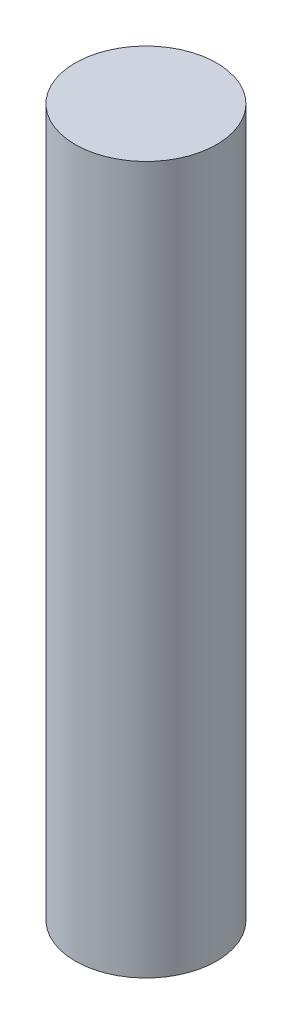
ISO-10303-21;
HEADER;
FILE_DESCRIPTION(('STEP AP214'),'2;1');
FILE_NAME('part.step','',(''),(''),'','','');
FILE_SCHEMA(('AUTOMOTIVE_DESIGN { 1 0 10303 214 1 1 1 1 }'));
ENDSEC;
DATA;
#1=APPLICATION_CONTEXT('core data for automotive mechanical design processes');
#2=APPLICATION_PROTOCOL_DEFINITION('international standard','automotive_design',2000,#1);
#3=PRODUCT_CONTEXT('',#1,'mechanical');
#4=PRODUCT('Part','Part','',(#3));
#5=PRODUCT_RELATED_PRODUCT_CATEGORY('part','',(#4));
#6=PRODUCT_DEFINITION_FORMATION('','',#4);
#7=PRODUCT_DEFINITION_CONTEXT('part definition',#1,'design');
#8=PRODUCT_DEFINITION('design','',#6,#7);
#9=PRODUCT_DEFINITION_SHAPE('','',#8);
#10=(LENGTH_UNIT() NAMED_UNIT(*) SI_UNIT(.MILLI.,.METRE.));
#11=(NAMED_UNIT(*) PLANE_ANGLE_UNIT() SI_UNIT($,.RADIAN.));
#12=(NAMED_UNIT(*) SI_UNIT($,.STERADIAN.) SOLID_ANGLE_UNIT());
#13=UNCERTAINTY_MEASURE_WITH_UNIT(LENGTH_MEASURE(1.E-05),#10,'distance_accuracy_value','');
#14=(GEOMETRIC_REPRESENTATION_CONTEXT(3) GLOBAL_UNCERTAINTY_ASSIGNED_CONTEXT((#13)) GLOBAL_UNIT_ASSIGNED_CONTEXT((#10,
#11,#12)) REPRESENTATION_CONTEXT('',''));
#15=CARTESIAN_POINT('',(0.,0.,0.));
#16=DIRECTION('',(0.,0.,1.));
#17=DIRECTION('',(1.,0.,0.));
#18=AXIS2_PLACEMENT_3D('',#15,#16,#17);
#19=CARTESIAN_POINT('',(0.,45.,0.));
#20=DIRECTION('',(0.,-1.,0.));
#21=DIRECTION('',(0.,0.,-1.));
#22=AXIS2_PLACEMENT_3D('',#19,#20,#21);
#23=CYLINDRICAL_SURFACE('',#22,4.5);
#24=CARTESIAN_POINT('',(0.,45.,0.));
#25=DIRECTION('',(0.,1.,0.));
#26=DIRECTION('',(0.,0.,1.));
#27=AXIS2_PLACEMENT_3D('',#24,#25,#26);
#28=CIRCLE('',#27,4.5);
#29=CARTESIAN_POINT('',(0.,45.,4.5));
#30=VERTEX_POINT('',#29);
#31=EDGE_CURVE('E10',#30,#30,#28,.T.);
#32=ORIENTED_EDGE('',*,*,#31,.F.);
#33=EDGE_LOOP('',(#32));
#34=FACE_BOUND('',#33,.T.);
#35=CARTESIAN_POINT('',(0.,0.,0.));
#36=DIRECTION('',(0.,1.,0.));
#37=DIRECTION('',(0.,0.,1.));
#38=AXIS2_PLACEMENT_3D('',#35,#36,#37);
#39=CIRCLE('',#38,4.5);
#40=CARTESIAN_POINT('',(0.,0.,4.5));
#41=VERTEX_POINT('',#40);
#42=EDGE_CURVE('E40',#41,#41,#39,.T.);
#43=ORIENTED_EDGE('',*,*,#42,.T.);
#44=EDGE_LOOP('',(#43));
#45=FACE_BOUND('',#44,.T.);
#46=ADVANCED_FACE('F37',(#34,#45),#23,.T.);
#47=CARTESIAN_POINT('',(0.,45.,0.));
#48=DIRECTION('',(0.,1.,0.));
#49=DIRECTION('',(0.,0.,1.));
#50=AXIS2_PLACEMENT_3D('',#47,#48,#49);
#51=PLANE('',#50);
#52=ORIENTED_EDGE('',*,*,#31,.T.);
#53=EDGE_LOOP('',(#52));
#54=FACE_BOUND('',#53,.T.);
#55=ADVANCED_FACE('F52',(#54),#51,.T.);
#56=CARTESIAN_POINT('',(0.,0.,0.));
#57=DIRECTION('',(0.,1.,0.));
#58=DIRECTION('',(0.,0.,1.));
#59=AXIS2_PLACEMENT_3D('',#56,#57,#58);
#60=PLANE('',#59);
#61=ORIENTED_EDGE('',*,*,#42,.F.);
#62=EDGE_LOOP('',(#61));
#63=FACE_BOUND('',#62,.T.);
#64=ADVANCED_FACE('F50',(#63),#60,.F.);
#65=CLOSED_SHELL('',(#46,#55,#64));
#66=MANIFOLD_SOLID_BREP('B2',#65);
#67=ADVANCED_BREP_SHAPE_REPRESENTATION('',(#18,#66),#14);
#68=SHAPE_DEFINITION_REPRESENTATION(#9,#67);
ENDSEC;
END-ISO-10303-21;
